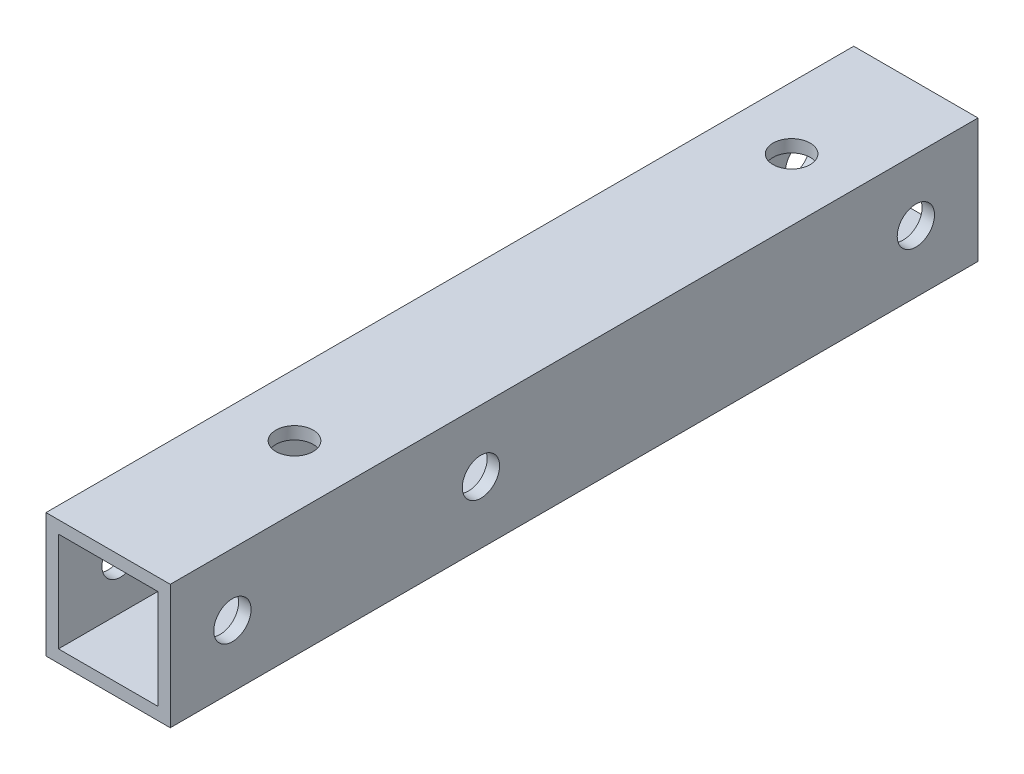
ISO-10303-21;
HEADER;
FILE_DESCRIPTION(('STEP AP214'),'2;1');
FILE_NAME('part.step','',(''),(''),'','','');
FILE_SCHEMA(('AUTOMOTIVE_DESIGN { 1 0 10303 214 1 1 1 1 }'));
ENDSEC;
DATA;
#1=APPLICATION_CONTEXT('core data for automotive mechanical design processes');
#2=APPLICATION_PROTOCOL_DEFINITION('international standard','automotive_design',2000,#1);
#3=PRODUCT_CONTEXT('',#1,'mechanical');
#4=PRODUCT('Part','Part','',(#3));
#5=PRODUCT_RELATED_PRODUCT_CATEGORY('part','',(#4));
#6=PRODUCT_DEFINITION_FORMATION('','',#4);
#7=PRODUCT_DEFINITION_CONTEXT('part definition',#1,'design');
#8=PRODUCT_DEFINITION('design','',#6,#7);
#9=PRODUCT_DEFINITION_SHAPE('','',#8);
#10=(LENGTH_UNIT() NAMED_UNIT(*) SI_UNIT(.MILLI.,.METRE.));
#11=(NAMED_UNIT(*) PLANE_ANGLE_UNIT() SI_UNIT($,.RADIAN.));
#12=(NAMED_UNIT(*) SI_UNIT($,.STERADIAN.) SOLID_ANGLE_UNIT());
#13=UNCERTAINTY_MEASURE_WITH_UNIT(LENGTH_MEASURE(1.E-05),#10,'distance_accuracy_value','');
#14=(GEOMETRIC_REPRESENTATION_CONTEXT(3) GLOBAL_UNCERTAINTY_ASSIGNED_CONTEXT((#13)) GLOBAL_UNIT_ASSIGNED_CONTEXT((#10,
#11,#12)) REPRESENTATION_CONTEXT('',''));
#15=CARTESIAN_POINT('',(0.,0.,0.));
#16=DIRECTION('',(0.,0.,1.));
#17=DIRECTION('',(1.,0.,0.));
#18=AXIS2_PLACEMENT_3D('',#15,#16,#17);
#19=CARTESIAN_POINT('',(0.,0.,65.));
#20=DIRECTION('',(0.,0.,1.));
#21=DIRECTION('',(1.,0.,0.));
#22=AXIS2_PLACEMENT_3D('',#19,#20,#21);
#23=PLANE('',#22);
#24=DIRECTION('',(0.,-1.,0.));
#25=VECTOR('',#24,1.);
#26=CARTESIAN_POINT('',(-5.,5.,65.));
#27=LINE('',#26,#25);
#28=CARTESIAN_POINT('',(-5.,5.,65.));
#29=VERTEX_POINT('',#28);
#30=CARTESIAN_POINT('',(-5.,-5.,65.));
#31=VERTEX_POINT('',#30);
#32=EDGE_CURVE('E168',#29,#31,#27,.T.);
#33=ORIENTED_EDGE('',*,*,#32,.T.);
#34=DIRECTION('',(1.,0.,0.));
#35=VECTOR('',#34,1.);
#36=CARTESIAN_POINT('',(-5.,-5.,65.));
#37=LINE('',#36,#35);
#38=CARTESIAN_POINT('',(5.,-5.,65.));
#39=VERTEX_POINT('',#38);
#40=EDGE_CURVE('E171',#31,#39,#37,.T.);
#41=ORIENTED_EDGE('',*,*,#40,.T.);
#42=DIRECTION('',(0.,1.,0.));
#43=VECTOR('',#42,1.);
#44=CARTESIAN_POINT('',(5.,5.,65.));
#45=LINE('',#44,#43);
#46=CARTESIAN_POINT('',(5.,5.,65.));
#47=VERTEX_POINT('',#46);
#48=EDGE_CURVE('E174',#39,#47,#45,.T.);
#49=ORIENTED_EDGE('',*,*,#48,.T.);
#50=DIRECTION('',(-1.,0.,0.));
#51=VECTOR('',#50,1.);
#52=CARTESIAN_POINT('',(-5.,5.,65.));
#53=LINE('',#52,#51);
#54=EDGE_CURVE('E176',#47,#29,#53,.T.);
#55=ORIENTED_EDGE('',*,*,#54,.T.);
#56=EDGE_LOOP('',(#33,#41,#49,#55));
#57=FACE_BOUND('',#56,.T.);
#58=DIRECTION('',(1.,0.,0.));
#59=VECTOR('',#58,1.);
#60=CARTESIAN_POINT('',(-5.,-4.,65.));
#61=LINE('',#60,#59);
#62=CARTESIAN_POINT('',(-4.,-4.,65.));
#63=VERTEX_POINT('',#62);
#64=CARTESIAN_POINT('',(4.,-4.,65.));
#65=VERTEX_POINT('',#64);
#66=EDGE_CURVE('E138',#63,#65,#61,.T.);
#67=ORIENTED_EDGE('',*,*,#66,.F.);
#68=DIRECTION('',(0.,-1.,0.));
#69=VECTOR('',#68,1.);
#70=CARTESIAN_POINT('',(-4.,5.,65.));
#71=LINE('',#70,#69);
#72=CARTESIAN_POINT('',(-4.,4.,65.));
#73=VERTEX_POINT('',#72);
#74=EDGE_CURVE('E130',#73,#63,#71,.T.);
#75=ORIENTED_EDGE('',*,*,#74,.F.);
#76=DIRECTION('',(-1.,0.,0.));
#77=VECTOR('',#76,1.);
#78=CARTESIAN_POINT('',(-5.,4.,65.));
#79=LINE('',#78,#77);
#80=CARTESIAN_POINT('',(4.,4.,65.));
#81=VERTEX_POINT('',#80);
#82=EDGE_CURVE('E152',#81,#73,#79,.T.);
#83=ORIENTED_EDGE('',*,*,#82,.F.);
#84=DIRECTION('',(0.,1.,0.));
#85=VECTOR('',#84,1.);
#86=CARTESIAN_POINT('',(4.,5.,65.));
#87=LINE('',#86,#85);
#88=EDGE_CURVE('E150',#65,#81,#87,.T.);
#89=ORIENTED_EDGE('',*,*,#88,.F.);
#90=EDGE_LOOP('',(#67,#75,#83,#89));
#91=FACE_BOUND('',#90,.T.);
#92=ADVANCED_FACE('F63',(#57,#91),#23,.T.);
#93=CARTESIAN_POINT('',(0.,0.,0.));
#94=DIRECTION('',(0.,0.,1.));
#95=DIRECTION('',(1.,0.,0.));
#96=AXIS2_PLACEMENT_3D('',#93,#94,#95);
#97=PLANE('',#96);
#98=DIRECTION('',(0.,-1.,0.));
#99=VECTOR('',#98,1.);
#100=CARTESIAN_POINT('',(-5.,5.,0.));
#101=LINE('',#100,#99);
#102=CARTESIAN_POINT('',(-5.,5.,0.));
#103=VERTEX_POINT('',#102);
#104=CARTESIAN_POINT('',(-5.,-5.,0.));
#105=VERTEX_POINT('',#104);
#106=EDGE_CURVE('E146',#103,#105,#101,.T.);
#107=ORIENTED_EDGE('',*,*,#106,.F.);
#108=DIRECTION('',(-1.,0.,0.));
#109=VECTOR('',#108,1.);
#110=CARTESIAN_POINT('',(-5.,5.,0.));
#111=LINE('',#110,#109);
#112=CARTESIAN_POINT('',(5.,5.,0.));
#113=VERTEX_POINT('',#112);
#114=EDGE_CURVE('E172',#113,#103,#111,.T.);
#115=ORIENTED_EDGE('',*,*,#114,.F.);
#116=DIRECTION('',(0.,1.,0.));
#117=VECTOR('',#116,1.);
#118=CARTESIAN_POINT('',(5.,5.,0.));
#119=LINE('',#118,#117);
#120=CARTESIAN_POINT('',(5.,-5.,0.));
#121=VERTEX_POINT('',#120);
#122=EDGE_CURVE('E183',#121,#113,#119,.T.);
#123=ORIENTED_EDGE('',*,*,#122,.F.);
#124=DIRECTION('',(1.,0.,0.));
#125=VECTOR('',#124,1.);
#126=CARTESIAN_POINT('',(-5.,-5.,0.));
#127=LINE('',#126,#125);
#128=EDGE_CURVE('E181',#105,#121,#127,.T.);
#129=ORIENTED_EDGE('',*,*,#128,.F.);
#130=EDGE_LOOP('',(#107,#115,#123,#129));
#131=FACE_BOUND('',#130,.T.);
#132=DIRECTION('',(0.,-1.,0.));
#133=VECTOR('',#132,1.);
#134=CARTESIAN_POINT('',(-4.,5.,0.));
#135=LINE('',#134,#133);
#136=CARTESIAN_POINT('',(-4.,4.,0.));
#137=VERTEX_POINT('',#136);
#138=CARTESIAN_POINT('',(-4.,-4.,0.));
#139=VERTEX_POINT('',#138);
#140=EDGE_CURVE('E88',#137,#139,#135,.T.);
#141=ORIENTED_EDGE('',*,*,#140,.T.);
#142=DIRECTION('',(1.,0.,0.));
#143=VECTOR('',#142,1.);
#144=CARTESIAN_POINT('',(-5.,-4.,0.));
#145=LINE('',#144,#143);
#146=CARTESIAN_POINT('',(4.,-4.,0.));
#147=VERTEX_POINT('',#146);
#148=EDGE_CURVE('E145',#139,#147,#145,.T.);
#149=ORIENTED_EDGE('',*,*,#148,.T.);
#150=DIRECTION('',(0.,1.,0.));
#151=VECTOR('',#150,1.);
#152=CARTESIAN_POINT('',(4.,5.,0.));
#153=LINE('',#152,#151);
#154=CARTESIAN_POINT('',(4.,4.,0.));
#155=VERTEX_POINT('',#154);
#156=EDGE_CURVE('E160',#147,#155,#153,.T.);
#157=ORIENTED_EDGE('',*,*,#156,.T.);
#158=DIRECTION('',(-1.,0.,0.));
#159=VECTOR('',#158,1.);
#160=CARTESIAN_POINT('',(-5.,4.,0.));
#161=LINE('',#160,#159);
#162=EDGE_CURVE('E139',#155,#137,#161,.T.);
#163=ORIENTED_EDGE('',*,*,#162,.T.);
#164=EDGE_LOOP('',(#141,#149,#157,#163));
#165=FACE_BOUND('',#164,.T.);
#166=ADVANCED_FACE('F276',(#131,#165),#97,.F.);
#167=CARTESIAN_POINT('',(-5.,5.,65.));
#168=DIRECTION('',(1.,0.,0.));
#169=DIRECTION('',(0.,0.,-1.));
#170=AXIS2_PLACEMENT_3D('',#167,#168,#169);
#171=PLANE('',#170);
#172=CARTESIAN_POINT('',(-5.,0.,5.));
#173=DIRECTION('',(-1.,0.,0.));
#174=DIRECTION('',(0.,0.,1.));
#175=AXIS2_PLACEMENT_3D('',#172,#173,#174);
#176=CIRCLE('',#175,1.5);
#177=CARTESIAN_POINT('',(-5.,0.,6.50000000000001));
#178=VERTEX_POINT('',#177);
#179=EDGE_CURVE('E238',#178,#178,#176,.T.);
#180=ORIENTED_EDGE('',*,*,#179,.F.);
#181=EDGE_LOOP('',(#180));
#182=FACE_BOUND('',#181,.T.);
#183=CARTESIAN_POINT('',(-5.,0.,60.));
#184=DIRECTION('',(-1.,0.,0.));
#185=DIRECTION('',(0.,0.,1.));
#186=AXIS2_PLACEMENT_3D('',#183,#184,#185);
#187=CIRCLE('',#186,1.5);
#188=CARTESIAN_POINT('',(-5.,0.,61.5));
#189=VERTEX_POINT('',#188);
#190=EDGE_CURVE('E231',#189,#189,#187,.T.);
#191=ORIENTED_EDGE('',*,*,#190,.F.);
#192=EDGE_LOOP('',(#191));
#193=FACE_BOUND('',#192,.T.);
#194=CARTESIAN_POINT('',(-5.,0.,40.));
#195=DIRECTION('',(-1.,0.,0.));
#196=DIRECTION('',(0.,0.,1.));
#197=AXIS2_PLACEMENT_3D('',#194,#195,#196);
#198=CIRCLE('',#197,1.5);
#199=CARTESIAN_POINT('',(-5.,0.,41.5));
#200=VERTEX_POINT('',#199);
#201=EDGE_CURVE('E234',#200,#200,#198,.T.);
#202=ORIENTED_EDGE('',*,*,#201,.F.);
#203=EDGE_LOOP('',(#202));
#204=FACE_BOUND('',#203,.T.);
#205=ORIENTED_EDGE('',*,*,#106,.T.);
#206=DIRECTION('',(0.,0.,-1.));
#207=VECTOR('',#206,1.);
#208=CARTESIAN_POINT('',(-5.,-5.,65.));
#209=LINE('',#208,#207);
#210=EDGE_CURVE('E12',#31,#105,#209,.T.);
#211=ORIENTED_EDGE('',*,*,#210,.F.);
#212=ORIENTED_EDGE('',*,*,#32,.F.);
#213=DIRECTION('',(0.,0.,-1.));
#214=VECTOR('',#213,1.);
#215=CARTESIAN_POINT('',(-5.,5.,65.));
#216=LINE('',#215,#214);
#217=EDGE_CURVE('E178',#29,#103,#216,.T.);
#218=ORIENTED_EDGE('',*,*,#217,.T.);
#219=EDGE_LOOP('',(#205,#211,#212,#218));
#220=FACE_BOUND('',#219,.T.);
#221=ADVANCED_FACE('F65',(#182,#193,#204,#220),#171,.F.);
#222=CARTESIAN_POINT('',(-5.,-5.,65.));
#223=DIRECTION('',(0.,1.,0.));
#224=DIRECTION('',(0.,0.,1.));
#225=AXIS2_PLACEMENT_3D('',#222,#223,#224);
#226=PLANE('',#225);
#227=CARTESIAN_POINT('',(0.,-5.,10.));
#228=DIRECTION('',(0.,1.,0.));
#229=DIRECTION('',(0.,0.,1.));
#230=AXIS2_PLACEMENT_3D('',#227,#228,#229);
#231=CIRCLE('',#230,3.5);
#232=CARTESIAN_POINT('',(0.,-5.,13.5));
#233=VERTEX_POINT('',#232);
#234=EDGE_CURVE('E214',#233,#233,#231,.T.);
#235=ORIENTED_EDGE('',*,*,#234,.T.);
#236=EDGE_LOOP('',(#235));
#237=FACE_BOUND('',#236,.T.);
#238=CARTESIAN_POINT('',(0.,-5.,50.));
#239=DIRECTION('',(0.,1.,0.));
#240=DIRECTION('',(0.,0.,1.));
#241=AXIS2_PLACEMENT_3D('',#238,#239,#240);
#242=CIRCLE('',#241,3.5);
#243=CARTESIAN_POINT('',(0.,-5.,53.5));
#244=VERTEX_POINT('',#243);
#245=EDGE_CURVE('E220',#244,#244,#242,.T.);
#246=ORIENTED_EDGE('',*,*,#245,.T.);
#247=EDGE_LOOP('',(#246));
#248=FACE_BOUND('',#247,.T.);
#249=ORIENTED_EDGE('',*,*,#128,.T.);
#250=DIRECTION('',(0.,0.,-1.));
#251=VECTOR('',#250,1.);
#252=CARTESIAN_POINT('',(5.,-5.,65.));
#253=LINE('',#252,#251);
#254=EDGE_CURVE('E72',#39,#121,#253,.T.);
#255=ORIENTED_EDGE('',*,*,#254,.F.);
#256=ORIENTED_EDGE('',*,*,#40,.F.);
#257=ORIENTED_EDGE('',*,*,#210,.T.);
#258=EDGE_LOOP('',(#249,#255,#256,#257));
#259=FACE_BOUND('',#258,.T.);
#260=ADVANCED_FACE('F275',(#237,#248,#259),#226,.F.);
#261=CARTESIAN_POINT('',(5.,5.,65.));
#262=DIRECTION('',(-1.,0.,0.));
#263=DIRECTION('',(0.,0.,1.));
#264=AXIS2_PLACEMENT_3D('',#261,#262,#263);
#265=PLANE('',#264);
#266=CARTESIAN_POINT('',(5.,0.,5.));
#267=DIRECTION('',(-1.,0.,0.));
#268=DIRECTION('',(0.,0.,1.));
#269=AXIS2_PLACEMENT_3D('',#266,#267,#268);
#270=CIRCLE('',#269,1.5);
#271=CARTESIAN_POINT('',(5.,0.,6.50000000000001));
#272=VERTEX_POINT('',#271);
#273=EDGE_CURVE('E211',#272,#272,#270,.T.);
#274=ORIENTED_EDGE('',*,*,#273,.T.);
#275=EDGE_LOOP('',(#274));
#276=FACE_BOUND('',#275,.T.);
#277=CARTESIAN_POINT('',(5.,0.,60.));
#278=DIRECTION('',(-1.,0.,0.));
#279=DIRECTION('',(0.,0.,1.));
#280=AXIS2_PLACEMENT_3D('',#277,#278,#279);
#281=CIRCLE('',#280,1.5);
#282=CARTESIAN_POINT('',(5.,0.,61.5));
#283=VERTEX_POINT('',#282);
#284=EDGE_CURVE('E235',#283,#283,#281,.T.);
#285=ORIENTED_EDGE('',*,*,#284,.T.);
#286=EDGE_LOOP('',(#285));
#287=FACE_BOUND('',#286,.T.);
#288=CARTESIAN_POINT('',(5.,0.,40.));
#289=DIRECTION('',(-1.,0.,0.));
#290=DIRECTION('',(0.,0.,1.));
#291=AXIS2_PLACEMENT_3D('',#288,#289,#290);
#292=CIRCLE('',#291,1.5);
#293=CARTESIAN_POINT('',(5.,0.,41.5));
#294=VERTEX_POINT('',#293);
#295=EDGE_CURVE('E197',#294,#294,#292,.T.);
#296=ORIENTED_EDGE('',*,*,#295,.T.);
#297=EDGE_LOOP('',(#296));
#298=FACE_BOUND('',#297,.T.);
#299=ORIENTED_EDGE('',*,*,#122,.T.);
#300=DIRECTION('',(0.,0.,-1.));
#301=VECTOR('',#300,1.);
#302=CARTESIAN_POINT('',(5.,5.,65.));
#303=LINE('',#302,#301);
#304=EDGE_CURVE('E188',#47,#113,#303,.T.);
#305=ORIENTED_EDGE('',*,*,#304,.F.);
#306=ORIENTED_EDGE('',*,*,#48,.F.);
#307=ORIENTED_EDGE('',*,*,#254,.T.);
#308=EDGE_LOOP('',(#299,#305,#306,#307));
#309=FACE_BOUND('',#308,.T.);
#310=ADVANCED_FACE('F294',(#276,#287,#298,#309),#265,.F.);
#311=CARTESIAN_POINT('',(-5.,5.,65.));
#312=DIRECTION('',(0.,-1.,0.));
#313=DIRECTION('',(0.,0.,-1.));
#314=AXIS2_PLACEMENT_3D('',#311,#312,#313);
#315=PLANE('',#314);
#316=CARTESIAN_POINT('',(0.,5.,50.));
#317=DIRECTION('',(0.,1.,0.));
#318=DIRECTION('',(0.,0.,1.));
#319=AXIS2_PLACEMENT_3D('',#316,#317,#318);
#320=CIRCLE('',#319,1.5);
#321=CARTESIAN_POINT('',(0.,5.,51.5));
#322=VERTEX_POINT('',#321);
#323=EDGE_CURVE('E209',#322,#322,#320,.T.);
#324=ORIENTED_EDGE('',*,*,#323,.F.);
#325=EDGE_LOOP('',(#324));
#326=FACE_BOUND('',#325,.T.);
#327=CARTESIAN_POINT('',(0.,5.,10.));
#328=DIRECTION('',(0.,1.,0.));
#329=DIRECTION('',(0.,0.,1.));
#330=AXIS2_PLACEMENT_3D('',#327,#328,#329);
#331=CIRCLE('',#330,1.5);
#332=CARTESIAN_POINT('',(0.,5.,11.5));
#333=VERTEX_POINT('',#332);
#334=EDGE_CURVE('E218',#333,#333,#331,.T.);
#335=ORIENTED_EDGE('',*,*,#334,.F.);
#336=EDGE_LOOP('',(#335));
#337=FACE_BOUND('',#336,.T.);
#338=ORIENTED_EDGE('',*,*,#114,.T.);
#339=ORIENTED_EDGE('',*,*,#217,.F.);
#340=ORIENTED_EDGE('',*,*,#54,.F.);
#341=ORIENTED_EDGE('',*,*,#304,.T.);
#342=EDGE_LOOP('',(#338,#339,#340,#341));
#343=FACE_BOUND('',#342,.T.);
#344=ADVANCED_FACE('F258',(#326,#337,#343),#315,.F.);
#345=CARTESIAN_POINT('',(-4.,5.,65.));
#346=DIRECTION('',(1.,0.,0.));
#347=DIRECTION('',(0.,0.,-1.));
#348=AXIS2_PLACEMENT_3D('',#345,#346,#347);
#349=PLANE('',#348);
#350=CARTESIAN_POINT('',(-4.,0.,5.));
#351=DIRECTION('',(1.,0.,0.));
#352=DIRECTION('',(0.,0.,-1.));
#353=AXIS2_PLACEMENT_3D('',#350,#351,#352);
#354=CIRCLE('',#353,1.5);
#355=CARTESIAN_POINT('',(-4.,0.,3.5));
#356=VERTEX_POINT('',#355);
#357=EDGE_CURVE('E158',#356,#356,#354,.T.);
#358=ORIENTED_EDGE('',*,*,#357,.F.);
#359=EDGE_LOOP('',(#358));
#360=FACE_BOUND('',#359,.T.);
#361=CARTESIAN_POINT('',(-4.,0.,60.));
#362=DIRECTION('',(1.,0.,0.));
#363=DIRECTION('',(0.,0.,-1.));
#364=AXIS2_PLACEMENT_3D('',#361,#362,#363);
#365=CIRCLE('',#364,1.5);
#366=CARTESIAN_POINT('',(-4.,0.,58.5));
#367=VERTEX_POINT('',#366);
#368=EDGE_CURVE('E201',#367,#367,#365,.T.);
#369=ORIENTED_EDGE('',*,*,#368,.F.);
#370=EDGE_LOOP('',(#369));
#371=FACE_BOUND('',#370,.T.);
#372=CARTESIAN_POINT('',(-4.,0.,40.));
#373=DIRECTION('',(1.,0.,0.));
#374=DIRECTION('',(0.,0.,-1.));
#375=AXIS2_PLACEMENT_3D('',#372,#373,#374);
#376=CIRCLE('',#375,1.5);
#377=CARTESIAN_POINT('',(-4.,0.,38.5));
#378=VERTEX_POINT('',#377);
#379=EDGE_CURVE('E196',#378,#378,#376,.T.);
#380=ORIENTED_EDGE('',*,*,#379,.F.);
#381=EDGE_LOOP('',(#380));
#382=FACE_BOUND('',#381,.T.);
#383=ORIENTED_EDGE('',*,*,#140,.F.);
#384=DIRECTION('',(0.,0.,-1.));
#385=VECTOR('',#384,1.);
#386=CARTESIAN_POINT('',(-4.,4.,65.));
#387=LINE('',#386,#385);
#388=EDGE_CURVE('E134',#73,#137,#387,.T.);
#389=ORIENTED_EDGE('',*,*,#388,.F.);
#390=ORIENTED_EDGE('',*,*,#74,.T.);
#391=DIRECTION('',(0.,0.,-1.));
#392=VECTOR('',#391,1.);
#393=CARTESIAN_POINT('',(-4.,-4.,65.));
#394=LINE('',#393,#392);
#395=EDGE_CURVE('E133',#63,#139,#394,.T.);
#396=ORIENTED_EDGE('',*,*,#395,.T.);
#397=EDGE_LOOP('',(#383,#389,#390,#396));
#398=FACE_BOUND('',#397,.T.);
#399=ADVANCED_FACE('F132',(#360,#371,#382,#398),#349,.T.);
#400=CARTESIAN_POINT('',(-5.,-4.,65.));
#401=DIRECTION('',(0.,1.,0.));
#402=DIRECTION('',(0.,0.,1.));
#403=AXIS2_PLACEMENT_3D('',#400,#401,#402);
#404=PLANE('',#403);
#405=CARTESIAN_POINT('',(0.,-4.,10.));
#406=DIRECTION('',(0.,1.,0.));
#407=DIRECTION('',(0.,0.,1.));
#408=AXIS2_PLACEMENT_3D('',#405,#406,#407);
#409=CIRCLE('',#408,3.5);
#410=CARTESIAN_POINT('',(0.,-4.,13.5));
#411=VERTEX_POINT('',#410);
#412=EDGE_CURVE('E67',#411,#411,#409,.T.);
#413=ORIENTED_EDGE('',*,*,#412,.F.);
#414=EDGE_LOOP('',(#413));
#415=FACE_BOUND('',#414,.T.);
#416=CARTESIAN_POINT('',(0.,-4.,50.));
#417=DIRECTION('',(0.,1.,0.));
#418=DIRECTION('',(0.,0.,1.));
#419=AXIS2_PLACEMENT_3D('',#416,#417,#418);
#420=CIRCLE('',#419,3.5);
#421=CARTESIAN_POINT('',(0.,-4.,53.5));
#422=VERTEX_POINT('',#421);
#423=EDGE_CURVE('E212',#422,#422,#420,.T.);
#424=ORIENTED_EDGE('',*,*,#423,.F.);
#425=EDGE_LOOP('',(#424));
#426=FACE_BOUND('',#425,.T.);
#427=ORIENTED_EDGE('',*,*,#148,.F.);
#428=ORIENTED_EDGE('',*,*,#395,.F.);
#429=ORIENTED_EDGE('',*,*,#66,.T.);
#430=DIRECTION('',(0.,0.,-1.));
#431=VECTOR('',#430,1.);
#432=CARTESIAN_POINT('',(4.,-4.,65.));
#433=LINE('',#432,#431);
#434=EDGE_CURVE('E147',#65,#147,#433,.T.);
#435=ORIENTED_EDGE('',*,*,#434,.T.);
#436=EDGE_LOOP('',(#427,#428,#429,#435));
#437=FACE_BOUND('',#436,.T.);
#438=ADVANCED_FACE('F142',(#415,#426,#437),#404,.T.);
#439=CARTESIAN_POINT('',(4.,5.,65.));
#440=DIRECTION('',(-1.,0.,0.));
#441=DIRECTION('',(0.,0.,1.));
#442=AXIS2_PLACEMENT_3D('',#439,#440,#441);
#443=PLANE('',#442);
#444=CARTESIAN_POINT('',(4.,0.,5.));
#445=DIRECTION('',(-1.,0.,0.));
#446=DIRECTION('',(0.,0.,1.));
#447=AXIS2_PLACEMENT_3D('',#444,#445,#446);
#448=CIRCLE('',#447,1.5);
#449=CARTESIAN_POINT('',(4.,0.,6.50000000000001));
#450=VERTEX_POINT('',#449);
#451=EDGE_CURVE('E202',#450,#450,#448,.T.);
#452=ORIENTED_EDGE('',*,*,#451,.F.);
#453=EDGE_LOOP('',(#452));
#454=FACE_BOUND('',#453,.T.);
#455=CARTESIAN_POINT('',(4.,0.,60.));
#456=DIRECTION('',(-1.,0.,0.));
#457=DIRECTION('',(0.,0.,1.));
#458=AXIS2_PLACEMENT_3D('',#455,#456,#457);
#459=CIRCLE('',#458,1.5);
#460=CARTESIAN_POINT('',(4.,0.,61.5));
#461=VERTEX_POINT('',#460);
#462=EDGE_CURVE('E198',#461,#461,#459,.T.);
#463=ORIENTED_EDGE('',*,*,#462,.F.);
#464=EDGE_LOOP('',(#463));
#465=FACE_BOUND('',#464,.T.);
#466=CARTESIAN_POINT('',(4.,0.,40.));
#467=DIRECTION('',(-1.,0.,0.));
#468=DIRECTION('',(0.,0.,1.));
#469=AXIS2_PLACEMENT_3D('',#466,#467,#468);
#470=CIRCLE('',#469,1.5);
#471=CARTESIAN_POINT('',(4.,0.,41.5));
#472=VERTEX_POINT('',#471);
#473=EDGE_CURVE('E193',#472,#472,#470,.T.);
#474=ORIENTED_EDGE('',*,*,#473,.F.);
#475=EDGE_LOOP('',(#474));
#476=FACE_BOUND('',#475,.T.);
#477=ORIENTED_EDGE('',*,*,#156,.F.);
#478=ORIENTED_EDGE('',*,*,#434,.F.);
#479=ORIENTED_EDGE('',*,*,#88,.T.);
#480=DIRECTION('',(0.,0.,-1.));
#481=VECTOR('',#480,1.);
#482=CARTESIAN_POINT('',(4.,4.,65.));
#483=LINE('',#482,#481);
#484=EDGE_CURVE('E80',#81,#155,#483,.T.);
#485=ORIENTED_EDGE('',*,*,#484,.T.);
#486=EDGE_LOOP('',(#477,#478,#479,#485));
#487=FACE_BOUND('',#486,.T.);
#488=ADVANCED_FACE('F314',(#454,#465,#476,#487),#443,.T.);
#489=CARTESIAN_POINT('',(-5.,4.,65.));
#490=DIRECTION('',(0.,-1.,0.));
#491=DIRECTION('',(0.,0.,-1.));
#492=AXIS2_PLACEMENT_3D('',#489,#490,#491);
#493=PLANE('',#492);
#494=CARTESIAN_POINT('',(0.,4.,50.));
#495=DIRECTION('',(0.,-1.,0.));
#496=DIRECTION('',(0.,0.,-1.));
#497=AXIS2_PLACEMENT_3D('',#494,#495,#496);
#498=CIRCLE('',#497,1.5);
#499=CARTESIAN_POINT('',(0.,4.,48.5));
#500=VERTEX_POINT('',#499);
#501=EDGE_CURVE('E208',#500,#500,#498,.T.);
#502=ORIENTED_EDGE('',*,*,#501,.F.);
#503=EDGE_LOOP('',(#502));
#504=FACE_BOUND('',#503,.T.);
#505=CARTESIAN_POINT('',(0.,4.,10.));
#506=DIRECTION('',(0.,-1.,0.));
#507=DIRECTION('',(0.,0.,-1.));
#508=AXIS2_PLACEMENT_3D('',#505,#506,#507);
#509=CIRCLE('',#508,1.5);
#510=CARTESIAN_POINT('',(0.,4.,8.5));
#511=VERTEX_POINT('',#510);
#512=EDGE_CURVE('E205',#511,#511,#509,.T.);
#513=ORIENTED_EDGE('',*,*,#512,.F.);
#514=EDGE_LOOP('',(#513));
#515=FACE_BOUND('',#514,.T.);
#516=ORIENTED_EDGE('',*,*,#162,.F.);
#517=ORIENTED_EDGE('',*,*,#484,.F.);
#518=ORIENTED_EDGE('',*,*,#82,.T.);
#519=ORIENTED_EDGE('',*,*,#388,.T.);
#520=EDGE_LOOP('',(#516,#517,#518,#519));
#521=FACE_BOUND('',#520,.T.);
#522=ADVANCED_FACE('F318',(#504,#515,#521),#493,.T.);
#523=CARTESIAN_POINT('',(5.,0.,40.));
#524=DIRECTION('',(-1.,0.,0.));
#525=DIRECTION('',(0.,0.,1.));
#526=AXIS2_PLACEMENT_3D('',#523,#524,#525);
#527=CYLINDRICAL_SURFACE('',#526,1.5);
#528=ORIENTED_EDGE('',*,*,#473,.T.);
#529=EDGE_LOOP('',(#528));
#530=FACE_BOUND('',#529,.T.);
#531=ORIENTED_EDGE('',*,*,#295,.F.);
#532=EDGE_LOOP('',(#531));
#533=FACE_BOUND('',#532,.T.);
#534=ADVANCED_FACE('F270',(#530,#533),#527,.F.);
#535=CARTESIAN_POINT('',(5.,0.,60.));
#536=DIRECTION('',(-1.,0.,0.));
#537=DIRECTION('',(0.,0.,1.));
#538=AXIS2_PLACEMENT_3D('',#535,#536,#537);
#539=CYLINDRICAL_SURFACE('',#538,1.5);
#540=ORIENTED_EDGE('',*,*,#462,.T.);
#541=EDGE_LOOP('',(#540));
#542=FACE_BOUND('',#541,.T.);
#543=ORIENTED_EDGE('',*,*,#284,.F.);
#544=EDGE_LOOP('',(#543));
#545=FACE_BOUND('',#544,.T.);
#546=ADVANCED_FACE('F324',(#542,#545),#539,.F.);
#547=CARTESIAN_POINT('',(5.,0.,5.));
#548=DIRECTION('',(-1.,0.,0.));
#549=DIRECTION('',(0.,0.,1.));
#550=AXIS2_PLACEMENT_3D('',#547,#548,#549);
#551=CYLINDRICAL_SURFACE('',#550,1.5);
#552=ORIENTED_EDGE('',*,*,#451,.T.);
#553=EDGE_LOOP('',(#552));
#554=FACE_BOUND('',#553,.T.);
#555=ORIENTED_EDGE('',*,*,#273,.F.);
#556=EDGE_LOOP('',(#555));
#557=FACE_BOUND('',#556,.T.);
#558=ADVANCED_FACE('F268',(#554,#557),#551,.F.);
#559=ORIENTED_EDGE('',*,*,#379,.T.);
#560=EDGE_LOOP('',(#559));
#561=FACE_BOUND('',#560,.T.);
#562=ORIENTED_EDGE('',*,*,#201,.T.);
#563=EDGE_LOOP('',(#562));
#564=FACE_BOUND('',#563,.T.);
#565=ADVANCED_FACE('F264',(#561,#564),#527,.F.);
#566=ORIENTED_EDGE('',*,*,#368,.T.);
#567=EDGE_LOOP('',(#566));
#568=FACE_BOUND('',#567,.T.);
#569=ORIENTED_EDGE('',*,*,#190,.T.);
#570=EDGE_LOOP('',(#569));
#571=FACE_BOUND('',#570,.T.);
#572=ADVANCED_FACE('F267',(#568,#571),#539,.F.);
#573=ORIENTED_EDGE('',*,*,#357,.T.);
#574=EDGE_LOOP('',(#573));
#575=FACE_BOUND('',#574,.T.);
#576=ORIENTED_EDGE('',*,*,#179,.T.);
#577=EDGE_LOOP('',(#576));
#578=FACE_BOUND('',#577,.T.);
#579=ADVANCED_FACE('F253',(#575,#578),#551,.F.);
#580=CARTESIAN_POINT('',(0.,-5.,10.));
#581=DIRECTION('',(0.,1.,0.));
#582=DIRECTION('',(0.,0.,1.));
#583=AXIS2_PLACEMENT_3D('',#580,#581,#582);
#584=CYLINDRICAL_SURFACE('',#583,1.5);
#585=ORIENTED_EDGE('',*,*,#512,.T.);
#586=EDGE_LOOP('',(#585));
#587=FACE_BOUND('',#586,.T.);
#588=ORIENTED_EDGE('',*,*,#334,.T.);
#589=EDGE_LOOP('',(#588));
#590=FACE_BOUND('',#589,.T.);
#591=ADVANCED_FACE('F332',(#587,#590),#584,.F.);
#592=CARTESIAN_POINT('',(0.,-5.,50.));
#593=DIRECTION('',(0.,1.,0.));
#594=DIRECTION('',(0.,0.,1.));
#595=AXIS2_PLACEMENT_3D('',#592,#593,#594);
#596=CYLINDRICAL_SURFACE('',#595,1.5);
#597=ORIENTED_EDGE('',*,*,#501,.T.);
#598=EDGE_LOOP('',(#597));
#599=FACE_BOUND('',#598,.T.);
#600=ORIENTED_EDGE('',*,*,#323,.T.);
#601=EDGE_LOOP('',(#600));
#602=FACE_BOUND('',#601,.T.);
#603=ADVANCED_FACE('F335',(#599,#602),#596,.F.);
#604=CARTESIAN_POINT('',(0.,-5.,50.));
#605=DIRECTION('',(0.,1.,0.));
#606=DIRECTION('',(0.,0.,1.));
#607=AXIS2_PLACEMENT_3D('',#604,#605,#606);
#608=CYLINDRICAL_SURFACE('',#607,3.5);
#609=ORIENTED_EDGE('',*,*,#423,.T.);
#610=EDGE_LOOP('',(#609));
#611=FACE_BOUND('',#610,.T.);
#612=ORIENTED_EDGE('',*,*,#245,.F.);
#613=EDGE_LOOP('',(#612));
#614=FACE_BOUND('',#613,.T.);
#615=ADVANCED_FACE('F339',(#611,#614),#608,.F.);
#616=CARTESIAN_POINT('',(0.,-5.,10.));
#617=DIRECTION('',(0.,1.,0.));
#618=DIRECTION('',(0.,0.,1.));
#619=AXIS2_PLACEMENT_3D('',#616,#617,#618);
#620=CYLINDRICAL_SURFACE('',#619,3.5);
#621=ORIENTED_EDGE('',*,*,#412,.T.);
#622=EDGE_LOOP('',(#621));
#623=FACE_BOUND('',#622,.T.);
#624=ORIENTED_EDGE('',*,*,#234,.F.);
#625=EDGE_LOOP('',(#624));
#626=FACE_BOUND('',#625,.T.);
#627=ADVANCED_FACE('F343',(#623,#626),#620,.F.);
#628=CLOSED_SHELL('',(#92,#166,#221,#260,#310,#344,#399,#438,#488,#522,#534,#546,#558,#565,#572,
#579,#591,#603,#615,#627));
#629=MANIFOLD_SOLID_BREP('B2',#628);
#630=ADVANCED_BREP_SHAPE_REPRESENTATION('',(#18,#629),#14);
#631=SHAPE_DEFINITION_REPRESENTATION(#9,#630);
ENDSEC;
END-ISO-10303-21;
